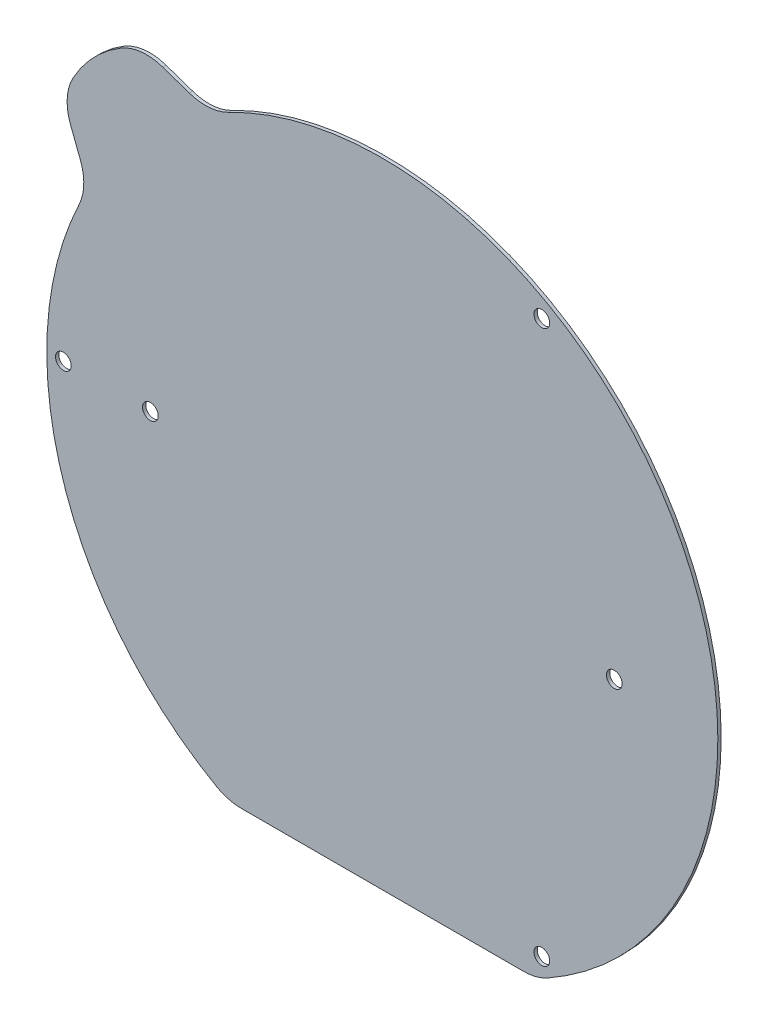
ISO-10303-21;
HEADER;
FILE_DESCRIPTION(('STEP AP214'),'2;1');
FILE_NAME('part.step','',(''),(''),'','','');
FILE_SCHEMA(('AUTOMOTIVE_DESIGN { 1 0 10303 214 1 1 1 1 }'));
ENDSEC;
DATA;
#1=APPLICATION_CONTEXT('core data for automotive mechanical design processes');
#2=APPLICATION_PROTOCOL_DEFINITION('international standard','automotive_design',2000,#1);
#3=PRODUCT_CONTEXT('',#1,'mechanical');
#4=PRODUCT('Part','Part','',(#3));
#5=PRODUCT_RELATED_PRODUCT_CATEGORY('part','',(#4));
#6=PRODUCT_DEFINITION_FORMATION('','',#4);
#7=PRODUCT_DEFINITION_CONTEXT('part definition',#1,'design');
#8=PRODUCT_DEFINITION('design','',#6,#7);
#9=PRODUCT_DEFINITION_SHAPE('','',#8);
#10=(LENGTH_UNIT() NAMED_UNIT(*) SI_UNIT(.MILLI.,.METRE.));
#11=(NAMED_UNIT(*) PLANE_ANGLE_UNIT() SI_UNIT($,.RADIAN.));
#12=(NAMED_UNIT(*) SI_UNIT($,.STERADIAN.) SOLID_ANGLE_UNIT());
#13=UNCERTAINTY_MEASURE_WITH_UNIT(LENGTH_MEASURE(1.E-05),#10,'distance_accuracy_value','');
#14=(GEOMETRIC_REPRESENTATION_CONTEXT(3) GLOBAL_UNCERTAINTY_ASSIGNED_CONTEXT((#13)) GLOBAL_UNIT_ASSIGNED_CONTEXT((#10,
#11,#12)) REPRESENTATION_CONTEXT('',''));
#15=CARTESIAN_POINT('',(0.,0.,0.));
#16=DIRECTION('',(0.,0.,1.));
#17=DIRECTION('',(1.,0.,0.));
#18=AXIS2_PLACEMENT_3D('',#15,#16,#17);
#19=CARTESIAN_POINT('',(-92.7698765763974,-180.,0.));
#20=DIRECTION('',(0.,-1.,0.));
#21=DIRECTION('',(1.,0.,0.));
#22=AXIS2_PLACEMENT_3D('',#19,#20,#21);
#23=PLANE('',#22);
#24=DIRECTION('',(0.,0.,1.));
#25=VECTOR('',#24,1.);
#26=CARTESIAN_POINT('',(-85.1836251870041,-180.,0.));
#27=LINE('',#26,#25);
#28=CARTESIAN_POINT('',(-85.1836251870041,-180.,-1.99999999999997));
#29=VERTEX_POINT('',#28);
#30=CARTESIAN_POINT('',(-85.1836251870041,-180.,0.));
#31=VERTEX_POINT('',#30);
#32=EDGE_CURVE('E12',#29,#31,#27,.T.);
#33=ORIENTED_EDGE('',*,*,#32,.F.);
#34=DIRECTION('',(1.,0.,0.));
#35=VECTOR('',#34,1.);
#36=CARTESIAN_POINT('',(0.,-180.,-1.99999999999998));
#37=LINE('',#36,#35);
#38=CARTESIAN_POINT('',(85.1836251870042,-180.,-1.99999999999999));
#39=VERTEX_POINT('',#38);
#40=EDGE_CURVE('E133',#29,#39,#37,.T.);
#41=ORIENTED_EDGE('',*,*,#40,.T.);
#42=DIRECTION('',(0.,0.,1.));
#43=VECTOR('',#42,1.);
#44=CARTESIAN_POINT('',(85.1836251870042,-180.,0.));
#45=LINE('',#44,#43);
#46=CARTESIAN_POINT('',(85.1836251870042,-180.,0.));
#47=VERTEX_POINT('',#46);
#48=EDGE_CURVE('E63',#39,#47,#45,.T.);
#49=ORIENTED_EDGE('',*,*,#48,.T.);
#50=DIRECTION('',(1.,0.,0.));
#51=VECTOR('',#50,1.);
#52=CARTESIAN_POINT('',(-92.7698765763974,-180.,0.));
#53=LINE('',#52,#51);
#54=EDGE_CURVE('E224',#31,#47,#53,.T.);
#55=ORIENTED_EDGE('',*,*,#54,.F.);
#56=EDGE_LOOP('',(#33,#41,#49,#55));
#57=FACE_BOUND('',#56,.T.);
#58=ADVANCED_FACE('F52',(#57),#23,.T.);
#59=CARTESIAN_POINT('',(85.1836251870042,-150.,0.));
#60=DIRECTION('',(0.,0.,1.));
#61=DIRECTION('',(1.,0.,0.));
#62=AXIS2_PLACEMENT_3D('',#59,#60,#61);
#63=CYLINDRICAL_SURFACE('',#62,30.);
#64=ORIENTED_EDGE('',*,*,#48,.F.);
#65=CARTESIAN_POINT('',(85.1836251870042,-150.,-2.00000000000006));
#66=DIRECTION('',(0.,0.,1.));
#67=DIRECTION('',(1.,0.,0.));
#68=AXIS2_PLACEMENT_3D('',#65,#66,#67);
#69=CIRCLE('',#68,30.);
#70=CARTESIAN_POINT('',(99.9981686977875,-176.086956521739,-2.));
#71=VERTEX_POINT('',#70);
#72=EDGE_CURVE('E179',#39,#71,#69,.T.);
#73=ORIENTED_EDGE('',*,*,#72,.T.);
#74=DIRECTION('',(0.,0.,1.));
#75=VECTOR('',#74,1.);
#76=CARTESIAN_POINT('',(99.9981686977875,-176.086956521739,0.));
#77=LINE('',#76,#75);
#78=CARTESIAN_POINT('',(99.9981686977875,-176.086956521739,0.));
#79=VERTEX_POINT('',#78);
#80=EDGE_CURVE('E214',#71,#79,#77,.T.);
#81=ORIENTED_EDGE('',*,*,#80,.T.);
#82=CARTESIAN_POINT('',(85.1836251870042,-150.,0.));
#83=DIRECTION('',(0.,0.,1.));
#84=DIRECTION('',(1.,0.,0.));
#85=AXIS2_PLACEMENT_3D('',#82,#83,#84);
#86=CIRCLE('',#85,30.);
#87=EDGE_CURVE('E233',#47,#79,#86,.T.);
#88=ORIENTED_EDGE('',*,*,#87,.F.);
#89=EDGE_LOOP('',(#64,#73,#81,#88));
#90=FACE_BOUND('',#89,.T.);
#91=ADVANCED_FACE('F237',(#90),#63,.T.);
#92=CARTESIAN_POINT('',(0.,0.,0.));
#93=DIRECTION('',(0.,0.,1.));
#94=DIRECTION('',(1.,0.,0.));
#95=AXIS2_PLACEMENT_3D('',#92,#93,#94);
#96=CYLINDRICAL_SURFACE('',#95,202.5);
#97=ORIENTED_EDGE('',*,*,#80,.F.);
#98=CARTESIAN_POINT('',(0.,0.,-2.));
#99=DIRECTION('',(0.,0.,1.));
#100=DIRECTION('',(1.,0.,0.));
#101=AXIS2_PLACEMENT_3D('',#98,#99,#100);
#102=CIRCLE('',#101,202.5);
#103=CARTESIAN_POINT('',(-92.9227085533015,179.921150049454,-2.));
#104=VERTEX_POINT('',#103);
#105=EDGE_CURVE('E175',#71,#104,#102,.T.);
#106=ORIENTED_EDGE('',*,*,#105,.T.);
#107=DIRECTION('',(0.,0.,1.));
#108=VECTOR('',#107,1.);
#109=CARTESIAN_POINT('',(-92.9227085533015,179.921150049454,0.));
#110=LINE('',#109,#108);
#111=CARTESIAN_POINT('',(-92.9227085533015,179.921150049454,0.));
#112=VERTEX_POINT('',#111);
#113=EDGE_CURVE('E210',#104,#112,#110,.T.);
#114=ORIENTED_EDGE('',*,*,#113,.T.);
#115=CARTESIAN_POINT('',(0.,0.,0.));
#116=DIRECTION('',(0.,0.,1.));
#117=DIRECTION('',(-1.,0.,0.));
#118=AXIS2_PLACEMENT_3D('',#115,#116,#117);
#119=CIRCLE('',#118,202.5);
#120=EDGE_CURVE('E239',#79,#112,#119,.T.);
#121=ORIENTED_EDGE('',*,*,#120,.F.);
#122=EDGE_LOOP('',(#97,#106,#114,#121));
#123=FACE_BOUND('',#122,.T.);
#124=ADVANCED_FACE('F323',(#123),#96,.T.);
#125=CARTESIAN_POINT('',(-106.689035746383,206.576135241966,0.));
#126=DIRECTION('',(0.,0.,1.));
#127=DIRECTION('',(1.,0.,0.));
#128=AXIS2_PLACEMENT_3D('',#125,#126,#127);
#129=CYLINDRICAL_SURFACE('',#128,30.);
#130=ORIENTED_EDGE('',*,*,#113,.F.);
#131=CARTESIAN_POINT('',(-106.689035746383,206.576135241966,-1.99999999999995));
#132=DIRECTION('',(0.,0.,1.));
#133=DIRECTION('',(1.,0.,0.));
#134=AXIS2_PLACEMENT_3D('',#131,#132,#133);
#135=CIRCLE('',#134,30.);
#136=CARTESIAN_POINT('',(-116.456080380098,178.210577973987,-2.));
#137=VERTEX_POINT('',#136);
#138=EDGE_CURVE('E171',#104,#137,#135,.F.);
#139=ORIENTED_EDGE('',*,*,#138,.T.);
#140=DIRECTION('',(0.,0.,1.));
#141=VECTOR('',#140,1.);
#142=CARTESIAN_POINT('',(-116.456080380098,178.210577973987,0.));
#143=LINE('',#142,#141);
#144=CARTESIAN_POINT('',(-116.456080380098,178.210577973987,0.));
#145=VERTEX_POINT('',#144);
#146=EDGE_CURVE('E206',#137,#145,#143,.T.);
#147=ORIENTED_EDGE('',*,*,#146,.T.);
#148=CARTESIAN_POINT('',(-106.689035746383,206.576135241966,0.));
#149=DIRECTION('',(0.,0.,1.));
#150=DIRECTION('',(1.,0.,0.));
#151=AXIS2_PLACEMENT_3D('',#148,#149,#150);
#152=CIRCLE('',#151,30.);
#153=EDGE_CURVE('E243',#112,#145,#152,.F.);
#154=ORIENTED_EDGE('',*,*,#153,.F.);
#155=EDGE_LOOP('',(#130,#139,#147,#154));
#156=FACE_BOUND('',#155,.T.);
#157=ADVANCED_FACE('F328',(#156),#129,.F.);
#158=CARTESIAN_POINT('',(-143.967492045359,187.683516690916,0.));
#159=DIRECTION('',(0.325568154457169,0.945518575599313,0.));
#160=DIRECTION('',(-0.945518575599313,0.325568154457169,0.));
#161=AXIS2_PLACEMENT_3D('',#158,#159,#160);
#162=PLANE('',#161);
#163=ORIENTED_EDGE('',*,*,#146,.F.);
#164=DIRECTION('',(-0.945518575599313,0.325568154457169,0.));
#165=VECTOR('',#164,1.);
#166=CARTESIAN_POINT('',(-143.967492045359,187.683516690916,-1.99999999999995));
#167=LINE('',#166,#165);
#168=CARTESIAN_POINT('',(-132.536384119264,183.747470581467,-2.));
#169=VERTEX_POINT('',#168);
#170=EDGE_CURVE('E167',#137,#169,#167,.T.);
#171=ORIENTED_EDGE('',*,*,#170,.T.);
#172=DIRECTION('',(0.,0.,1.));
#173=VECTOR('',#172,1.);
#174=CARTESIAN_POINT('',(-132.536384119264,183.747470581467,1.11022302462516E-13));
#175=LINE('',#174,#173);
#176=CARTESIAN_POINT('',(-132.536384119264,183.747470581467,1.11022302462516E-13));
#177=VERTEX_POINT('',#176);
#178=EDGE_CURVE('E202',#169,#177,#175,.T.);
#179=ORIENTED_EDGE('',*,*,#178,.T.);
#180=DIRECTION('',(-0.945518575599313,0.325568154457169,0.));
#181=VECTOR('',#180,1.);
#182=CARTESIAN_POINT('',(-143.967492045359,187.683516690916,0.));
#183=LINE('',#182,#181);
#184=EDGE_CURVE('E259',#145,#177,#183,.T.);
#185=ORIENTED_EDGE('',*,*,#184,.F.);
#186=EDGE_LOOP('',(#163,#171,#179,#185));
#187=FACE_BOUND('',#186,.T.);
#188=ADVANCED_FACE('F332',(#187),#162,.T.);
#189=CARTESIAN_POINT('',(-142.303428752979,155.381913313487,0.));
#190=DIRECTION('',(0.,0.,1.));
#191=DIRECTION('',(1.,0.,0.));
#192=AXIS2_PLACEMENT_3D('',#189,#190,#191);
#193=CYLINDRICAL_SURFACE('',#192,30.);
#194=ORIENTED_EDGE('',*,*,#178,.F.);
#195=CARTESIAN_POINT('',(-142.303428752979,155.381913313487,-2.));
#196=DIRECTION('',(0.,0.,1.));
#197=DIRECTION('',(1.,0.,0.));
#198=AXIS2_PLACEMENT_3D('',#195,#196,#197);
#199=CIRCLE('',#198,30.);
#200=CARTESIAN_POINT('',(-157.76565741185,181.090267692965,-1.99999999999999));
#201=VERTEX_POINT('',#200);
#202=EDGE_CURVE('E163',#169,#201,#199,.T.);
#203=ORIENTED_EDGE('',*,*,#202,.T.);
#204=DIRECTION('',(0.,0.,1.));
#205=VECTOR('',#204,1.);
#206=CARTESIAN_POINT('',(-157.76565741185,181.090267692965,1.11022302462516E-13));
#207=LINE('',#206,#205);
#208=CARTESIAN_POINT('',(-157.76565741185,181.090267692965,1.11022302462516E-13));
#209=VERTEX_POINT('',#208);
#210=EDGE_CURVE('E198',#201,#209,#207,.T.);
#211=ORIENTED_EDGE('',*,*,#210,.T.);
#212=CARTESIAN_POINT('',(-142.303428752979,155.381913313487,0.));
#213=DIRECTION('',(0.,0.,1.));
#214=DIRECTION('',(1.,0.,0.));
#215=AXIS2_PLACEMENT_3D('',#212,#213,#214);
#216=CIRCLE('',#215,30.);
#217=EDGE_CURVE('E263',#177,#209,#216,.T.);
#218=ORIENTED_EDGE('',*,*,#217,.F.);
#219=EDGE_LOOP('',(#194,#203,#211,#218));
#220=FACE_BOUND('',#219,.T.);
#221=ADVANCED_FACE('F336',(#220),#193,.T.);
#222=CARTESIAN_POINT('',(-116.533047654861,112.534656014358,0.));
#223=DIRECTION('',(0.,0.,1.));
#224=DIRECTION('',(1.,0.,0.));
#225=AXIS2_PLACEMENT_3D('',#222,#223,#224);
#226=CYLINDRICAL_SURFACE('',#225,80.);
#227=ORIENTED_EDGE('',*,*,#210,.F.);
#228=CARTESIAN_POINT('',(-116.533047654861,112.534656014358,-1.99999999999995));
#229=DIRECTION('',(0.,0.,1.));
#230=DIRECTION('',(1.,0.,0.));
#231=AXIS2_PLACEMENT_3D('',#228,#229,#230);
#232=CIRCLE('',#231,80.);
#233=CARTESIAN_POINT('',(-186.485894435392,151.349591635836,-1.99999999999999));
#234=VERTEX_POINT('',#233);
#235=EDGE_CURVE('E159',#201,#234,#232,.T.);
#236=ORIENTED_EDGE('',*,*,#235,.T.);
#237=DIRECTION('',(0.,0.,1.));
#238=VECTOR('',#237,1.);
#239=CARTESIAN_POINT('',(-186.485894435392,151.349591635836,0.));
#240=LINE('',#239,#238);
#241=CARTESIAN_POINT('',(-186.485894435392,151.349591635836,0.));
#242=VERTEX_POINT('',#241);
#243=EDGE_CURVE('E194',#234,#242,#240,.T.);
#244=ORIENTED_EDGE('',*,*,#243,.T.);
#245=CARTESIAN_POINT('',(-116.533047654861,112.534656014358,0.));
#246=DIRECTION('',(0.,0.,1.));
#247=DIRECTION('',(-1.,0.,0.));
#248=AXIS2_PLACEMENT_3D('',#245,#246,#247);
#249=CIRCLE('',#248,80.);
#250=EDGE_CURVE('E268',#209,#242,#249,.T.);
#251=ORIENTED_EDGE('',*,*,#250,.F.);
#252=EDGE_LOOP('',(#227,#236,#244,#251));
#253=FACE_BOUND('',#252,.T.);
#254=ADVANCED_FACE('F340',(#253),#226,.T.);
#255=CARTESIAN_POINT('',(-160.253576892693,136.793990777782,0.));
#256=DIRECTION('',(0.,0.,1.));
#257=DIRECTION('',(1.,0.,0.));
#258=AXIS2_PLACEMENT_3D('',#255,#256,#257);
#259=CYLINDRICAL_SURFACE('',#258,30.);
#260=ORIENTED_EDGE('',*,*,#243,.F.);
#261=CARTESIAN_POINT('',(-160.253576892693,136.793990777782,-1.99999999999995));
#262=DIRECTION('',(0.,0.,1.));
#263=DIRECTION('',(1.,0.,0.));
#264=AXIS2_PLACEMENT_3D('',#261,#262,#263);
#265=CIRCLE('',#264,30.);
#266=CARTESIAN_POINT('',(-188.260989687609,126.042952291423,-1.99999999999998));
#267=VERTEX_POINT('',#266);
#268=EDGE_CURVE('E155',#234,#267,#265,.T.);
#269=ORIENTED_EDGE('',*,*,#268,.T.);
#270=DIRECTION('',(0.,0.,1.));
#271=VECTOR('',#270,1.);
#272=CARTESIAN_POINT('',(-188.260989687609,126.042952291423,0.));
#273=LINE('',#272,#271);
#274=CARTESIAN_POINT('',(-188.260989687609,126.042952291423,0.));
#275=VERTEX_POINT('',#274);
#276=EDGE_CURVE('E190',#267,#275,#273,.T.);
#277=ORIENTED_EDGE('',*,*,#276,.T.);
#278=CARTESIAN_POINT('',(-160.253576892693,136.793990777782,0.));
#279=DIRECTION('',(0.,0.,1.));
#280=DIRECTION('',(1.,0.,0.));
#281=AXIS2_PLACEMENT_3D('',#278,#279,#280);
#282=CIRCLE('',#281,30.);
#283=EDGE_CURVE('E273',#242,#275,#282,.T.);
#284=ORIENTED_EDGE('',*,*,#283,.F.);
#285=EDGE_LOOP('',(#260,#269,#277,#284));
#286=FACE_BOUND('',#285,.T.);
#287=ADVANCED_FACE('F344',(#286),#259,.T.);
#288=CARTESIAN_POINT('',(-192.593577977489,137.32973066721,0.));
#289=DIRECTION('',(-0.933580426497201,-0.358367949545302,0.));
#290=DIRECTION('',(0.358367949545302,-0.933580426497201,0.));
#291=AXIS2_PLACEMENT_3D('',#288,#289,#290);
#292=PLANE('',#291);
#293=ORIENTED_EDGE('',*,*,#276,.F.);
#294=DIRECTION('',(0.358367949545302,-0.933580426497201,0.));
#295=VECTOR('',#294,1.);
#296=CARTESIAN_POINT('',(-192.593577977489,137.32973066721,-1.99999999999995));
#297=LINE('',#296,#295);
#298=CARTESIAN_POINT('',(-182.166275498184,110.165679004117,-1.99999999999998));
#299=VERTEX_POINT('',#298);
#300=EDGE_CURVE('E151',#267,#299,#297,.T.);
#301=ORIENTED_EDGE('',*,*,#300,.T.);
#302=DIRECTION('',(0.,0.,1.));
#303=VECTOR('',#302,1.);
#304=CARTESIAN_POINT('',(-182.166275498184,110.165679004117,0.));
#305=LINE('',#304,#303);
#306=CARTESIAN_POINT('',(-182.166275498184,110.165679004117,0.));
#307=VERTEX_POINT('',#306);
#308=EDGE_CURVE('E187',#299,#307,#305,.T.);
#309=ORIENTED_EDGE('',*,*,#308,.T.);
#310=DIRECTION('',(0.358367949545302,-0.933580426497201,0.));
#311=VECTOR('',#310,1.);
#312=CARTESIAN_POINT('',(-192.593577977489,137.32973066721,0.));
#313=LINE('',#312,#311);
#314=EDGE_CURVE('E277',#275,#307,#313,.T.);
#315=ORIENTED_EDGE('',*,*,#314,.F.);
#316=EDGE_LOOP('',(#293,#301,#309,#315));
#317=FACE_BOUND('',#316,.T.);
#318=ADVANCED_FACE('F348',(#317),#292,.T.);
#319=CARTESIAN_POINT('',(-210.1736882931,99.4146405177574,0.));
#320=DIRECTION('',(0.,0.,1.));
#321=DIRECTION('',(1.,0.,0.));
#322=AXIS2_PLACEMENT_3D('',#319,#320,#321);
#323=CYLINDRICAL_SURFACE('',#322,30.);
#324=ORIENTED_EDGE('',*,*,#308,.F.);
#325=CARTESIAN_POINT('',(-210.1736882931,99.4146405177574,-2.));
#326=DIRECTION('',(0.,0.,1.));
#327=DIRECTION('',(1.,0.,0.));
#328=AXIS2_PLACEMENT_3D('',#325,#326,#327);
#329=CIRCLE('',#328,30.);
#330=CARTESIAN_POINT('',(-183.054502706893,86.5869449670792,-1.99999999999998));
#331=VERTEX_POINT('',#330);
#332=EDGE_CURVE('E147',#299,#331,#329,.F.);
#333=ORIENTED_EDGE('',*,*,#332,.T.);
#334=DIRECTION('',(0.,0.,1.));
#335=VECTOR('',#334,1.);
#336=CARTESIAN_POINT('',(-183.054502706893,86.5869449670791,0.));
#337=LINE('',#336,#335);
#338=CARTESIAN_POINT('',(-183.054502706893,86.5869449670791,0.));
#339=VERTEX_POINT('',#338);
#340=EDGE_CURVE('E71',#331,#339,#337,.T.);
#341=ORIENTED_EDGE('',*,*,#340,.T.);
#342=CARTESIAN_POINT('',(-210.1736882931,99.4146405177574,0.));
#343=DIRECTION('',(0.,0.,1.));
#344=DIRECTION('',(1.,0.,0.));
#345=AXIS2_PLACEMENT_3D('',#342,#343,#344);
#346=CIRCLE('',#345,30.);
#347=EDGE_CURVE('E126',#307,#339,#346,.F.);
#348=ORIENTED_EDGE('',*,*,#347,.F.);
#349=EDGE_LOOP('',(#324,#333,#341,#348));
#350=FACE_BOUND('',#349,.T.);
#351=ADVANCED_FACE('F352',(#350),#323,.F.);
#352=CARTESIAN_POINT('',(0.,0.,0.));
#353=DIRECTION('',(0.,0.,1.));
#354=DIRECTION('',(1.,0.,0.));
#355=AXIS2_PLACEMENT_3D('',#352,#353,#354);
#356=CYLINDRICAL_SURFACE('',#355,202.5);
#357=ORIENTED_EDGE('',*,*,#340,.F.);
#358=CARTESIAN_POINT('',(0.,0.,-2.));
#359=DIRECTION('',(0.,0.,1.));
#360=DIRECTION('',(1.,0.,0.));
#361=AXIS2_PLACEMENT_3D('',#358,#359,#360);
#362=CIRCLE('',#361,202.5);
#363=CARTESIAN_POINT('',(-99.9981686977874,-176.086956521739,-1.99999999999996));
#364=VERTEX_POINT('',#363);
#365=EDGE_CURVE('E131',#331,#364,#362,.T.);
#366=ORIENTED_EDGE('',*,*,#365,.T.);
#367=DIRECTION('',(0.,0.,1.));
#368=VECTOR('',#367,1.);
#369=CARTESIAN_POINT('',(-99.9981686977874,-176.086956521739,0.));
#370=LINE('',#369,#368);
#371=CARTESIAN_POINT('',(-99.9981686977874,-176.086956521739,0.));
#372=VERTEX_POINT('',#371);
#373=EDGE_CURVE('E56',#364,#372,#370,.T.);
#374=ORIENTED_EDGE('',*,*,#373,.T.);
#375=CARTESIAN_POINT('',(0.,0.,0.));
#376=DIRECTION('',(0.,0.,1.));
#377=DIRECTION('',(1.,0.,0.));
#378=AXIS2_PLACEMENT_3D('',#375,#376,#377);
#379=CIRCLE('',#378,202.5);
#380=EDGE_CURVE('E396',#339,#372,#379,.T.);
#381=ORIENTED_EDGE('',*,*,#380,.F.);
#382=EDGE_LOOP('',(#357,#366,#374,#381));
#383=FACE_BOUND('',#382,.T.);
#384=ADVANCED_FACE('F136',(#383),#356,.T.);
#385=CARTESIAN_POINT('',(140.,0.,0.));
#386=DIRECTION('',(0.,0.,1.));
#387=DIRECTION('',(1.,0.,0.));
#388=AXIS2_PLACEMENT_3D('',#385,#386,#387);
#389=CYLINDRICAL_SURFACE('',#388,4.75);
#390=CARTESIAN_POINT('',(140.,0.,0.));
#391=DIRECTION('',(0.,0.,1.));
#392=DIRECTION('',(1.,0.,0.));
#393=AXIS2_PLACEMENT_3D('',#390,#391,#392);
#394=CIRCLE('',#393,4.75);
#395=CARTESIAN_POINT('',(144.75,0.,0.));
#396=VERTEX_POINT('',#395);
#397=EDGE_CURVE('E150',#396,#396,#394,.T.);
#398=ORIENTED_EDGE('',*,*,#397,.T.);
#399=EDGE_LOOP('',(#398));
#400=FACE_BOUND('',#399,.T.);
#401=CARTESIAN_POINT('',(140.,0.,-2.00000000000006));
#402=DIRECTION('',(0.,0.,1.));
#403=DIRECTION('',(1.,0.,0.));
#404=AXIS2_PLACEMENT_3D('',#401,#402,#403);
#405=CIRCLE('',#404,4.75);
#406=CARTESIAN_POINT('',(144.75,0.,-2.00000000000006));
#407=VERTEX_POINT('',#406);
#408=EDGE_CURVE('E285',#407,#407,#405,.T.);
#409=ORIENTED_EDGE('',*,*,#408,.F.);
#410=EDGE_LOOP('',(#409));
#411=FACE_BOUND('',#410,.T.);
#412=ADVANCED_FACE('F357',(#400,#411),#389,.F.);
#413=CARTESIAN_POINT('',(-140.,0.,0.));
#414=DIRECTION('',(0.,0.,1.));
#415=DIRECTION('',(1.,0.,0.));
#416=AXIS2_PLACEMENT_3D('',#413,#414,#415);
#417=CYLINDRICAL_SURFACE('',#416,4.75);
#418=CARTESIAN_POINT('',(-140.,0.,0.));
#419=DIRECTION('',(0.,0.,1.));
#420=DIRECTION('',(1.,0.,0.));
#421=AXIS2_PLACEMENT_3D('',#418,#419,#420);
#422=CIRCLE('',#421,4.75);
#423=CARTESIAN_POINT('',(-135.25,0.,0.));
#424=VERTEX_POINT('',#423);
#425=EDGE_CURVE('E384',#424,#424,#422,.T.);
#426=ORIENTED_EDGE('',*,*,#425,.T.);
#427=EDGE_LOOP('',(#426));
#428=FACE_BOUND('',#427,.T.);
#429=CARTESIAN_POINT('',(-140.,0.,-1.99999999999995));
#430=DIRECTION('',(0.,0.,1.));
#431=DIRECTION('',(1.,0.,0.));
#432=AXIS2_PLACEMENT_3D('',#429,#430,#431);
#433=CIRCLE('',#432,4.75);
#434=CARTESIAN_POINT('',(-135.25,0.,-1.99999999999994));
#435=VERTEX_POINT('',#434);
#436=EDGE_CURVE('E289',#435,#435,#433,.T.);
#437=ORIENTED_EDGE('',*,*,#436,.F.);
#438=EDGE_LOOP('',(#437));
#439=FACE_BOUND('',#438,.T.);
#440=ADVANCED_FACE('F315',(#428,#439),#417,.F.);
#441=CARTESIAN_POINT('',(-192.5,-2.08166817117217E-12,0.));
#442=DIRECTION('',(0.,0.,1.));
#443=DIRECTION('',(1.,0.,0.));
#444=AXIS2_PLACEMENT_3D('',#441,#442,#443);
#445=CYLINDRICAL_SURFACE('',#444,4.75);
#446=CARTESIAN_POINT('',(-192.5,-2.08166817117217E-12,0.));
#447=DIRECTION('',(0.,0.,1.));
#448=DIRECTION('',(1.,0.,0.));
#449=AXIS2_PLACEMENT_3D('',#446,#447,#448);
#450=CIRCLE('',#449,4.75);
#451=CARTESIAN_POINT('',(-187.75,-2.08193184914052E-12,0.));
#452=VERTEX_POINT('',#451);
#453=EDGE_CURVE('E388',#452,#452,#450,.T.);
#454=ORIENTED_EDGE('',*,*,#453,.T.);
#455=EDGE_LOOP('',(#454));
#456=FACE_BOUND('',#455,.T.);
#457=CARTESIAN_POINT('',(-192.5,-2.08189021577709E-12,-1.99999999999995));
#458=DIRECTION('',(0.,0.,1.));
#459=DIRECTION('',(1.,0.,0.));
#460=AXIS2_PLACEMENT_3D('',#457,#458,#459);
#461=CIRCLE('',#460,4.75);
#462=CARTESIAN_POINT('',(-187.75,-2.08189021577709E-12,-1.99999999999994));
#463=VERTEX_POINT('',#462);
#464=EDGE_CURVE('E293',#463,#463,#461,.T.);
#465=ORIENTED_EDGE('',*,*,#464,.F.);
#466=EDGE_LOOP('',(#465));
#467=FACE_BOUND('',#466,.T.);
#468=ADVANCED_FACE('F306',(#456,#467),#445,.F.);
#469=CARTESIAN_POINT('',(96.249999999999,166.709890228505,0.));
#470=DIRECTION('',(0.,0.,1.));
#471=DIRECTION('',(1.,0.,0.));
#472=AXIS2_PLACEMENT_3D('',#469,#470,#471);
#473=CYLINDRICAL_SURFACE('',#472,4.75);
#474=CARTESIAN_POINT('',(96.249999999999,166.709890228505,0.));
#475=DIRECTION('',(0.,0.,1.));
#476=DIRECTION('',(1.,0.,0.));
#477=AXIS2_PLACEMENT_3D('',#474,#475,#476);
#478=CIRCLE('',#477,4.75);
#479=CARTESIAN_POINT('',(100.999999999999,166.709890228505,0.));
#480=VERTEX_POINT('',#479);
#481=EDGE_CURVE('E391',#480,#480,#478,.T.);
#482=ORIENTED_EDGE('',*,*,#481,.T.);
#483=EDGE_LOOP('',(#482));
#484=FACE_BOUND('',#483,.T.);
#485=CARTESIAN_POINT('',(96.249999999999,166.709890228505,-1.99999999999995));
#486=DIRECTION('',(0.,0.,1.));
#487=DIRECTION('',(1.,0.,0.));
#488=AXIS2_PLACEMENT_3D('',#485,#486,#487);
#489=CIRCLE('',#488,4.75);
#490=CARTESIAN_POINT('',(100.999999999999,166.709890228505,-1.99999999999994));
#491=VERTEX_POINT('',#490);
#492=EDGE_CURVE('E143',#491,#491,#489,.T.);
#493=ORIENTED_EDGE('',*,*,#492,.F.);
#494=EDGE_LOOP('',(#493));
#495=FACE_BOUND('',#494,.T.);
#496=ADVANCED_FACE('F303',(#484,#495),#473,.F.);
#497=CARTESIAN_POINT('',(96.2500000000003,-166.709890228504,0.));
#498=DIRECTION('',(0.,0.,1.));
#499=DIRECTION('',(1.,0.,0.));
#500=AXIS2_PLACEMENT_3D('',#497,#498,#499);
#501=CYLINDRICAL_SURFACE('',#500,4.75);
#502=CARTESIAN_POINT('',(96.2500000000003,-166.709890228504,0.));
#503=DIRECTION('',(0.,0.,1.));
#504=DIRECTION('',(1.,0.,0.));
#505=AXIS2_PLACEMENT_3D('',#502,#503,#504);
#506=CIRCLE('',#505,4.75);
#507=CARTESIAN_POINT('',(101.,-166.709890228504,0.));
#508=VERTEX_POINT('',#507);
#509=EDGE_CURVE('E394',#508,#508,#506,.T.);
#510=ORIENTED_EDGE('',*,*,#509,.T.);
#511=EDGE_LOOP('',(#510));
#512=FACE_BOUND('',#511,.T.);
#513=CARTESIAN_POINT('',(96.2500000000003,-166.709890228504,-2.));
#514=DIRECTION('',(0.,0.,1.));
#515=DIRECTION('',(1.,0.,0.));
#516=AXIS2_PLACEMENT_3D('',#513,#514,#515);
#517=CIRCLE('',#516,4.75);
#518=CARTESIAN_POINT('',(101.,-166.709890228504,-2.));
#519=VERTEX_POINT('',#518);
#520=EDGE_CURVE('E138',#519,#519,#517,.T.);
#521=ORIENTED_EDGE('',*,*,#520,.F.);
#522=EDGE_LOOP('',(#521));
#523=FACE_BOUND('',#522,.T.);
#524=ADVANCED_FACE('F305',(#512,#523),#501,.F.);
#525=CARTESIAN_POINT('',(-85.1836251870041,-150.,0.));
#526=DIRECTION('',(0.,0.,1.));
#527=DIRECTION('',(1.,0.,0.));
#528=AXIS2_PLACEMENT_3D('',#525,#526,#527);
#529=CYLINDRICAL_SURFACE('',#528,30.);
#530=CARTESIAN_POINT('',(-85.1836251870041,-150.,-2.));
#531=DIRECTION('',(0.,0.,1.));
#532=DIRECTION('',(1.,0.,0.));
#533=AXIS2_PLACEMENT_3D('',#530,#531,#532);
#534=CIRCLE('',#533,30.);
#535=EDGE_CURVE('E119',#364,#29,#534,.T.);
#536=ORIENTED_EDGE('',*,*,#535,.T.);
#537=ORIENTED_EDGE('',*,*,#32,.T.);
#538=CARTESIAN_POINT('',(-85.1836251870041,-150.,0.));
#539=DIRECTION('',(0.,0.,1.));
#540=DIRECTION('',(1.,0.,0.));
#541=AXIS2_PLACEMENT_3D('',#538,#539,#540);
#542=CIRCLE('',#541,30.);
#543=EDGE_CURVE('E121',#372,#31,#542,.T.);
#544=ORIENTED_EDGE('',*,*,#543,.F.);
#545=ORIENTED_EDGE('',*,*,#373,.F.);
#546=EDGE_LOOP('',(#536,#537,#544,#545));
#547=FACE_BOUND('',#546,.T.);
#548=ADVANCED_FACE('F54',(#547),#529,.T.);
#549=CARTESIAN_POINT('',(0.,0.,0.));
#550=DIRECTION('',(0.,0.,1.));
#551=DIRECTION('',(1.,0.,0.));
#552=AXIS2_PLACEMENT_3D('',#549,#550,#551);
#553=PLANE('',#552);
#554=ORIENTED_EDGE('',*,*,#397,.F.);
#555=EDGE_LOOP('',(#554));
#556=FACE_BOUND('',#555,.T.);
#557=ORIENTED_EDGE('',*,*,#425,.F.);
#558=EDGE_LOOP('',(#557));
#559=FACE_BOUND('',#558,.T.);
#560=ORIENTED_EDGE('',*,*,#453,.F.);
#561=EDGE_LOOP('',(#560));
#562=FACE_BOUND('',#561,.T.);
#563=ORIENTED_EDGE('',*,*,#481,.F.);
#564=EDGE_LOOP('',(#563));
#565=FACE_BOUND('',#564,.T.);
#566=ORIENTED_EDGE('',*,*,#509,.F.);
#567=EDGE_LOOP('',(#566));
#568=FACE_BOUND('',#567,.T.);
#569=ORIENTED_EDGE('',*,*,#380,.T.);
#570=ORIENTED_EDGE('',*,*,#543,.T.);
#571=ORIENTED_EDGE('',*,*,#54,.T.);
#572=ORIENTED_EDGE('',*,*,#87,.T.);
#573=ORIENTED_EDGE('',*,*,#120,.T.);
#574=ORIENTED_EDGE('',*,*,#153,.T.);
#575=ORIENTED_EDGE('',*,*,#184,.T.);
#576=ORIENTED_EDGE('',*,*,#217,.T.);
#577=ORIENTED_EDGE('',*,*,#250,.T.);
#578=ORIENTED_EDGE('',*,*,#283,.T.);
#579=ORIENTED_EDGE('',*,*,#314,.T.);
#580=ORIENTED_EDGE('',*,*,#347,.T.);
#581=EDGE_LOOP('',(#569,#570,#571,#572,#573,#574,#575,#576,#577,#578,#579,#580));
#582=FACE_BOUND('',#581,.T.);
#583=ADVANCED_FACE('F231',(#556,#559,#562,#565,#568,#582),#553,.T.);
#584=CARTESIAN_POINT('',(0.,0.,-2.));
#585=DIRECTION('',(0.,0.,1.));
#586=DIRECTION('',(1.,0.,0.));
#587=AXIS2_PLACEMENT_3D('',#584,#585,#586);
#588=PLANE('',#587);
#589=ORIENTED_EDGE('',*,*,#408,.T.);
#590=EDGE_LOOP('',(#589));
#591=FACE_BOUND('',#590,.T.);
#592=ORIENTED_EDGE('',*,*,#436,.T.);
#593=EDGE_LOOP('',(#592));
#594=FACE_BOUND('',#593,.T.);
#595=ORIENTED_EDGE('',*,*,#464,.T.);
#596=EDGE_LOOP('',(#595));
#597=FACE_BOUND('',#596,.T.);
#598=ORIENTED_EDGE('',*,*,#492,.T.);
#599=EDGE_LOOP('',(#598));
#600=FACE_BOUND('',#599,.T.);
#601=ORIENTED_EDGE('',*,*,#520,.T.);
#602=EDGE_LOOP('',(#601));
#603=FACE_BOUND('',#602,.T.);
#604=ORIENTED_EDGE('',*,*,#365,.F.);
#605=ORIENTED_EDGE('',*,*,#332,.F.);
#606=ORIENTED_EDGE('',*,*,#300,.F.);
#607=ORIENTED_EDGE('',*,*,#268,.F.);
#608=ORIENTED_EDGE('',*,*,#235,.F.);
#609=ORIENTED_EDGE('',*,*,#202,.F.);
#610=ORIENTED_EDGE('',*,*,#170,.F.);
#611=ORIENTED_EDGE('',*,*,#138,.F.);
#612=ORIENTED_EDGE('',*,*,#105,.F.);
#613=ORIENTED_EDGE('',*,*,#72,.F.);
#614=ORIENTED_EDGE('',*,*,#40,.F.);
#615=ORIENTED_EDGE('',*,*,#535,.F.);
#616=EDGE_LOOP('',(#604,#605,#606,#607,#608,#609,#610,#611,#612,#613,#614,#615));
#617=FACE_BOUND('',#616,.T.);
#618=ADVANCED_FACE('F129',(#591,#594,#597,#600,#603,#617),#588,.F.);
#619=CLOSED_SHELL('',(#58,#91,#124,#157,#188,#221,#254,#287,#318,#351,#384,#412,#440,#468,#496,
#524,#548,#583,#618));
#620=MANIFOLD_SOLID_BREP('B2',#619);
#621=ADVANCED_BREP_SHAPE_REPRESENTATION('',(#18,#620),#14);
#622=SHAPE_DEFINITION_REPRESENTATION(#9,#621);
ENDSEC;
END-ISO-10303-21;
